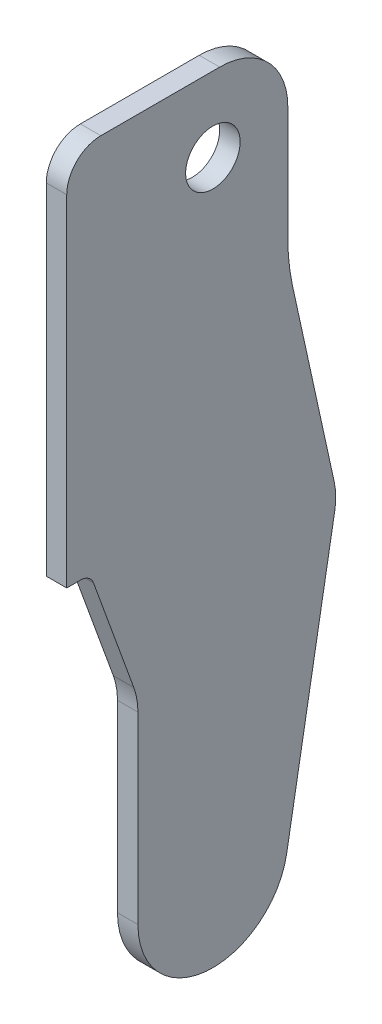
ISO-10303-21;
HEADER;
FILE_DESCRIPTION(('STEP AP214'),'2;1');
FILE_NAME('part.step','',(''),(''),'','','');
FILE_SCHEMA(('AUTOMOTIVE_DESIGN { 1 0 10303 214 1 1 1 1 }'));
ENDSEC;
DATA;
#1=APPLICATION_CONTEXT('core data for automotive mechanical design processes');
#2=APPLICATION_PROTOCOL_DEFINITION('international standard','automotive_design',2000,#1);
#3=PRODUCT_CONTEXT('',#1,'mechanical');
#4=PRODUCT('Part','Part','',(#3));
#5=PRODUCT_RELATED_PRODUCT_CATEGORY('part','',(#4));
#6=PRODUCT_DEFINITION_FORMATION('','',#4);
#7=PRODUCT_DEFINITION_CONTEXT('part definition',#1,'design');
#8=PRODUCT_DEFINITION('design','',#6,#7);
#9=PRODUCT_DEFINITION_SHAPE('','',#8);
#10=(LENGTH_UNIT() NAMED_UNIT(*) SI_UNIT(.MILLI.,.METRE.));
#11=(NAMED_UNIT(*) PLANE_ANGLE_UNIT() SI_UNIT($,.RADIAN.));
#12=(NAMED_UNIT(*) SI_UNIT($,.STERADIAN.) SOLID_ANGLE_UNIT());
#13=UNCERTAINTY_MEASURE_WITH_UNIT(LENGTH_MEASURE(1.E-05),#10,'distance_accuracy_value','');
#14=(GEOMETRIC_REPRESENTATION_CONTEXT(3) GLOBAL_UNCERTAINTY_ASSIGNED_CONTEXT((#13)) GLOBAL_UNIT_ASSIGNED_CONTEXT((#10,
#11,#12)) REPRESENTATION_CONTEXT('',''));
#15=CARTESIAN_POINT('',(0.,0.,0.));
#16=DIRECTION('',(0.,0.,1.));
#17=DIRECTION('',(1.,0.,0.));
#18=AXIS2_PLACEMENT_3D('',#15,#16,#17);
#19=CARTESIAN_POINT('',(17.5,-190.,21.4494897427832));
#20=DIRECTION('',(0.,0.,1.));
#21=DIRECTION('',(1.,0.,0.));
#22=AXIS2_PLACEMENT_3D('',#19,#20,#21);
#23=PLANE('',#22);
#24=DIRECTION('',(0.,1.,0.));
#25=VECTOR('',#24,1.);
#26=CARTESIAN_POINT('',(17.5,-190.,21.4494897427832));
#27=LINE('',#26,#25);
#28=CARTESIAN_POINT('',(17.5,-190.,21.4494897427832));
#29=VERTEX_POINT('',#28);
#30=CARTESIAN_POINT('',(17.5,-140.,21.4494897427832));
#31=VERTEX_POINT('',#30);
#32=EDGE_CURVE('E176',#29,#31,#27,.T.);
#33=ORIENTED_EDGE('',*,*,#32,.T.);
#34=DIRECTION('',(-1.,0.,0.));
#35=VECTOR('',#34,1.);
#36=CARTESIAN_POINT('',(17.5,-140.,21.4494897427832));
#37=LINE('',#36,#35);
#38=CARTESIAN_POINT('',(14.5,-140.,21.4494897427832));
#39=VERTEX_POINT('',#38);
#40=EDGE_CURVE('E245',#31,#39,#37,.T.);
#41=ORIENTED_EDGE('',*,*,#40,.T.);
#42=DIRECTION('',(0.,1.,0.));
#43=VECTOR('',#42,1.);
#44=CARTESIAN_POINT('',(14.5,-190.,21.4494897427832));
#45=LINE('',#44,#43);
#46=CARTESIAN_POINT('',(14.5,-190.,21.4494897427832));
#47=VERTEX_POINT('',#46);
#48=EDGE_CURVE('E213',#47,#39,#45,.T.);
#49=ORIENTED_EDGE('',*,*,#48,.F.);
#50=DIRECTION('',(-1.,0.,0.));
#51=VECTOR('',#50,1.);
#52=CARTESIAN_POINT('',(17.5,-190.,21.4494897427832));
#53=LINE('',#52,#51);
#54=EDGE_CURVE('E243',#29,#47,#53,.T.);
#55=ORIENTED_EDGE('',*,*,#54,.F.);
#56=EDGE_LOOP('',(#33,#41,#49,#55));
#57=FACE_BOUND('',#56,.T.);
#58=ADVANCED_FACE('F39',(#57),#23,.T.);
#59=CARTESIAN_POINT('',(17.5,-190.000000000001,19.40041507642));
#60=DIRECTION('',(0.,-1.,5.28271354274638E-13));
#61=DIRECTION('',(0.,-5.28271354274638E-13,-1.));
#62=AXIS2_PLACEMENT_3D('',#59,#60,#61);
#63=PLANE('',#62);
#64=ORIENTED_EDGE('',*,*,#54,.T.);
#65=DIRECTION('',(0.,5.28271354274638E-13,1.));
#66=VECTOR('',#65,1.);
#67=CARTESIAN_POINT('',(14.5,-190.000000000001,19.40041507642));
#68=LINE('',#67,#66);
#69=CARTESIAN_POINT('',(14.5,-190.000000000002,19.40041507642));
#70=VERTEX_POINT('',#69);
#71=EDGE_CURVE('E180',#70,#47,#68,.T.);
#72=ORIENTED_EDGE('',*,*,#71,.F.);
#73=DIRECTION('',(-1.,0.,0.));
#74=VECTOR('',#73,1.);
#75=CARTESIAN_POINT('',(17.5,-190.000000000002,19.40041507642));
#76=LINE('',#75,#74);
#77=CARTESIAN_POINT('',(17.5,-190.000000000002,19.40041507642));
#78=VERTEX_POINT('',#77);
#79=EDGE_CURVE('E246',#78,#70,#76,.T.);
#80=ORIENTED_EDGE('',*,*,#79,.F.);
#81=DIRECTION('',(0.,5.28271354274638E-13,1.));
#82=VECTOR('',#81,1.);
#83=CARTESIAN_POINT('',(17.5,-190.000000000001,19.40041507642));
#84=LINE('',#83,#82);
#85=EDGE_CURVE('E210',#78,#29,#84,.T.);
#86=ORIENTED_EDGE('',*,*,#85,.T.);
#87=EDGE_LOOP('',(#64,#72,#80,#86));
#88=FACE_BOUND('',#87,.T.);
#89=ADVANCED_FACE('F276',(#88),#63,.T.);
#90=CARTESIAN_POINT('',(17.5,-192.,19.40041507642));
#91=DIRECTION('',(-1.,0.,0.));
#92=DIRECTION('',(0.,0.,1.));
#93=AXIS2_PLACEMENT_3D('',#90,#91,#92);
#94=CYLINDRICAL_SURFACE('',#93,1.99999999999838);
#95=ORIENTED_EDGE('',*,*,#79,.T.);
#96=CARTESIAN_POINT('',(14.5,-192.,19.40041507642));
#97=DIRECTION('',(1.,0.,0.));
#98=DIRECTION('',(0.,0.,1.));
#99=AXIS2_PLACEMENT_3D('',#96,#97,#98);
#100=CIRCLE('',#99,1.99999999999838);
#101=CARTESIAN_POINT('',(14.5,-191.31595971335,17.52102983485));
#102=VERTEX_POINT('',#101);
#103=EDGE_CURVE('E238',#102,#70,#100,.T.);
#104=ORIENTED_EDGE('',*,*,#103,.F.);
#105=DIRECTION('',(-1.,0.,0.));
#106=VECTOR('',#105,1.);
#107=CARTESIAN_POINT('',(17.5,-191.31595971335,17.52102983485));
#108=LINE('',#107,#106);
#109=CARTESIAN_POINT('',(17.5,-191.31595971335,17.52102983485));
#110=VERTEX_POINT('',#109);
#111=EDGE_CURVE('E248',#110,#102,#108,.T.);
#112=ORIENTED_EDGE('',*,*,#111,.F.);
#113=CARTESIAN_POINT('',(17.5,-192.,19.40041507642));
#114=DIRECTION('',(1.,0.,0.));
#115=DIRECTION('',(0.,0.,1.));
#116=AXIS2_PLACEMENT_3D('',#113,#114,#115);
#117=CIRCLE('',#116,1.99999999999838);
#118=EDGE_CURVE('E207',#110,#78,#117,.T.);
#119=ORIENTED_EDGE('',*,*,#118,.T.);
#120=EDGE_LOOP('',(#95,#104,#112,#119));
#121=FACE_BOUND('',#120,.T.);
#122=ADVANCED_FACE('F294',(#121),#94,.F.);
#123=CARTESIAN_POINT('',(17.5,-207.57541031001,11.6030737921409));
#124=DIRECTION('',(0.,-0.342020143325815,0.939692620785855));
#125=DIRECTION('',(0.,-0.939692620785855,-0.342020143325815));
#126=AXIS2_PLACEMENT_3D('',#123,#124,#125);
#127=PLANE('',#126);
#128=ORIENTED_EDGE('',*,*,#111,.T.);
#129=DIRECTION('',(0.,0.939692620785855,0.342020143325814));
#130=VECTOR('',#129,1.);
#131=CARTESIAN_POINT('',(14.5,-207.57541031001,11.6030737921409));
#132=LINE('',#131,#130);
#133=CARTESIAN_POINT('',(14.5,-207.575410310011,11.6030737921414));
#134=VERTEX_POINT('',#133);
#135=EDGE_CURVE('E235',#134,#102,#132,.T.);
#136=ORIENTED_EDGE('',*,*,#135,.F.);
#137=DIRECTION('',(-1.,0.,0.));
#138=VECTOR('',#137,1.);
#139=CARTESIAN_POINT('',(17.5,-207.575410310011,11.6030737921414));
#140=LINE('',#139,#138);
#141=CARTESIAN_POINT('',(17.5,-207.575410310011,11.6030737921414));
#142=VERTEX_POINT('',#141);
#143=EDGE_CURVE('E250',#142,#134,#140,.T.);
#144=ORIENTED_EDGE('',*,*,#143,.F.);
#145=DIRECTION('',(0.,0.939692620785855,0.342020143325814));
#146=VECTOR('',#145,1.);
#147=CARTESIAN_POINT('',(17.5,-207.57541031001,11.6030737921409));
#148=LINE('',#147,#146);
#149=EDGE_CURVE('E204',#142,#110,#148,.T.);
#150=ORIENTED_EDGE('',*,*,#149,.T.);
#151=EDGE_LOOP('',(#128,#136,#144,#150));
#152=FACE_BOUND('',#151,.T.);
#153=ADVANCED_FACE('F329',(#152),#127,.T.);
#154=CARTESIAN_POINT('',(17.5,-210.99561174327,21.));
#155=DIRECTION('',(-1.,0.,0.));
#156=DIRECTION('',(0.,0.,1.));
#157=AXIS2_PLACEMENT_3D('',#154,#155,#156);
#158=CYLINDRICAL_SURFACE('',#157,10.0000000000005);
#159=ORIENTED_EDGE('',*,*,#143,.T.);
#160=CARTESIAN_POINT('',(14.5,-210.99561174327,21.));
#161=DIRECTION('',(1.,0.,0.));
#162=DIRECTION('',(0.,0.,1.));
#163=AXIS2_PLACEMENT_3D('',#160,#161,#162);
#164=CIRCLE('',#163,10.0000000000005);
#165=CARTESIAN_POINT('',(14.5,-210.99561174327,11.));
#166=VERTEX_POINT('',#165);
#167=EDGE_CURVE('E232',#166,#134,#164,.T.);
#168=ORIENTED_EDGE('',*,*,#167,.F.);
#169=DIRECTION('',(-1.,0.,0.));
#170=VECTOR('',#169,1.);
#171=CARTESIAN_POINT('',(17.5,-210.99561174327,11.));
#172=LINE('',#171,#170);
#173=CARTESIAN_POINT('',(17.5,-210.99561174327,11.));
#174=VERTEX_POINT('',#173);
#175=EDGE_CURVE('E252',#174,#166,#172,.T.);
#176=ORIENTED_EDGE('',*,*,#175,.F.);
#177=CARTESIAN_POINT('',(17.5,-210.99561174327,21.));
#178=DIRECTION('',(1.,0.,0.));
#179=DIRECTION('',(0.,0.,1.));
#180=AXIS2_PLACEMENT_3D('',#177,#178,#179);
#181=CIRCLE('',#180,10.0000000000005);
#182=EDGE_CURVE('E201',#174,#142,#181,.T.);
#183=ORIENTED_EDGE('',*,*,#182,.T.);
#184=EDGE_LOOP('',(#159,#168,#176,#183));
#185=FACE_BOUND('',#184,.T.);
#186=ADVANCED_FACE('F325',(#185),#158,.F.);
#187=CARTESIAN_POINT('',(17.5,-238.,10.9999999999979));
#188=DIRECTION('',(0.,0.,1.));
#189=DIRECTION('',(0.,-1.,0.));
#190=AXIS2_PLACEMENT_3D('',#187,#188,#189);
#191=PLANE('',#190);
#192=ORIENTED_EDGE('',*,*,#175,.T.);
#193=DIRECTION('',(0.,1.,0.));
#194=VECTOR('',#193,1.);
#195=CARTESIAN_POINT('',(14.5,-238.,10.9999999999979));
#196=LINE('',#195,#194);
#197=CARTESIAN_POINT('',(14.5,-238.,10.9999999999969));
#198=VERTEX_POINT('',#197);
#199=EDGE_CURVE('E229',#198,#166,#196,.T.);
#200=ORIENTED_EDGE('',*,*,#199,.F.);
#201=DIRECTION('',(-1.,0.,0.));
#202=VECTOR('',#201,1.);
#203=CARTESIAN_POINT('',(17.5,-238.,10.9999999999969));
#204=LINE('',#203,#202);
#205=CARTESIAN_POINT('',(17.5,-238.,10.9999999999969));
#206=VERTEX_POINT('',#205);
#207=EDGE_CURVE('E254',#206,#198,#204,.T.);
#208=ORIENTED_EDGE('',*,*,#207,.F.);
#209=DIRECTION('',(0.,1.,0.));
#210=VECTOR('',#209,1.);
#211=CARTESIAN_POINT('',(17.5,-238.,10.9999999999979));
#212=LINE('',#211,#210);
#213=EDGE_CURVE('E198',#206,#174,#212,.T.);
#214=ORIENTED_EDGE('',*,*,#213,.T.);
#215=EDGE_LOOP('',(#192,#200,#208,#214));
#216=FACE_BOUND('',#215,.T.);
#217=ADVANCED_FACE('F321',(#216),#191,.T.);
#218=CARTESIAN_POINT('',(17.5,-238.,0.));
#219=DIRECTION('',(-1.,0.,0.));
#220=DIRECTION('',(0.,0.,1.));
#221=AXIS2_PLACEMENT_3D('',#218,#219,#220);
#222=CYLINDRICAL_SURFACE('',#221,10.9999999999969);
#223=ORIENTED_EDGE('',*,*,#207,.T.);
#224=CARTESIAN_POINT('',(14.5,-238.,0.));
#225=DIRECTION('',(-1.,0.,0.));
#226=DIRECTION('',(0.,0.,1.));
#227=AXIS2_PLACEMENT_3D('',#224,#225,#226);
#228=CIRCLE('',#227,10.9999999999969);
#229=CARTESIAN_POINT('',(14.5,-239.91012995434,-10.83288528313));
#230=VERTEX_POINT('',#229);
#231=EDGE_CURVE('E226',#230,#198,#228,.T.);
#232=ORIENTED_EDGE('',*,*,#231,.F.);
#233=DIRECTION('',(-1.,0.,0.));
#234=VECTOR('',#233,1.);
#235=CARTESIAN_POINT('',(17.5,-239.91012995434,-10.83288528313));
#236=LINE('',#235,#234);
#237=CARTESIAN_POINT('',(17.5,-239.91012995434,-10.83288528313));
#238=VERTEX_POINT('',#237);
#239=EDGE_CURVE('E256',#238,#230,#236,.T.);
#240=ORIENTED_EDGE('',*,*,#239,.F.);
#241=CARTESIAN_POINT('',(17.5,-238.,0.));
#242=DIRECTION('',(-1.,0.,0.));
#243=DIRECTION('',(0.,0.,1.));
#244=AXIS2_PLACEMENT_3D('',#241,#242,#243);
#245=CIRCLE('',#244,10.9999999999963);
#246=EDGE_CURVE('E196',#238,#206,#245,.T.);
#247=ORIENTED_EDGE('',*,*,#246,.T.);
#248=EDGE_LOOP('',(#223,#232,#240,#247));
#249=FACE_BOUND('',#248,.T.);
#250=ADVANCED_FACE('F317',(#249),#222,.T.);
#251=CARTESIAN_POINT('',(17.5,-199.94512735731,-17.8797935250715));
#252=DIRECTION('',(0.,-0.173648177666962,-0.984807753012202));
#253=DIRECTION('',(0.,0.984807753012202,-0.173648177666962));
#254=AXIS2_PLACEMENT_3D('',#251,#252,#253);
#255=PLANE('',#254);
#256=ORIENTED_EDGE('',*,*,#239,.T.);
#257=DIRECTION('',(0.,-0.984807753012202,0.173648177666962));
#258=VECTOR('',#257,1.);
#259=CARTESIAN_POINT('',(14.5,-199.94512735731,-17.8797935250715));
#260=LINE('',#259,#258);
#261=CARTESIAN_POINT('',(14.5,-199.94512735731,-17.8797935250723));
#262=VERTEX_POINT('',#261);
#263=EDGE_CURVE('E223',#262,#230,#260,.T.);
#264=ORIENTED_EDGE('',*,*,#263,.F.);
#265=DIRECTION('',(-1.,0.,0.));
#266=VECTOR('',#265,1.);
#267=CARTESIAN_POINT('',(17.5,-199.94512735731,-17.8797935250723));
#268=LINE('',#267,#266);
#269=CARTESIAN_POINT('',(17.5,-199.94512735731,-17.8797935250723));
#270=VERTEX_POINT('',#269);
#271=EDGE_CURVE('E258',#270,#262,#268,.T.);
#272=ORIENTED_EDGE('',*,*,#271,.F.);
#273=DIRECTION('',(0.,-0.984807753012202,0.173648177666962));
#274=VECTOR('',#273,1.);
#275=CARTESIAN_POINT('',(17.5,-199.94512735731,-17.8797935250715));
#276=LINE('',#275,#274);
#277=EDGE_CURVE('E193',#270,#238,#276,.T.);
#278=ORIENTED_EDGE('',*,*,#277,.T.);
#279=EDGE_LOOP('',(#256,#264,#272,#278));
#280=FACE_BOUND('',#279,.T.);
#281=ADVANCED_FACE('F313',(#280),#255,.T.);
#282=CARTESIAN_POINT('',(17.5,-198.20864558064,-8.031715994952));
#283=DIRECTION('',(-1.,0.,0.));
#284=DIRECTION('',(0.,0.,1.));
#285=AXIS2_PLACEMENT_3D('',#282,#283,#284);
#286=CYLINDRICAL_SURFACE('',#285,9.99999999999843);
#287=ORIENTED_EDGE('',*,*,#271,.T.);
#288=CARTESIAN_POINT('',(14.5,-198.20864558064,-8.031715994952));
#289=DIRECTION('',(-1.,0.,0.));
#290=DIRECTION('',(0.,0.,1.));
#291=AXIS2_PLACEMENT_3D('',#288,#289,#290);
#292=CIRCLE('',#291,9.99999999999843);
#293=CARTESIAN_POINT('',(14.5,-196.07054058552,-17.80046755438));
#294=VERTEX_POINT('',#293);
#295=EDGE_CURVE('E220',#294,#262,#292,.T.);
#296=ORIENTED_EDGE('',*,*,#295,.F.);
#297=DIRECTION('',(-1.,0.,0.));
#298=VECTOR('',#297,1.);
#299=CARTESIAN_POINT('',(17.5,-196.07054058552,-17.80046755438));
#300=LINE('',#299,#298);
#301=CARTESIAN_POINT('',(17.5,-196.07054058552,-17.80046755438));
#302=VERTEX_POINT('',#301);
#303=EDGE_CURVE('E260',#302,#294,#300,.T.);
#304=ORIENTED_EDGE('',*,*,#303,.F.);
#305=CARTESIAN_POINT('',(17.5,-198.20864558064,-8.031715994952));
#306=DIRECTION('',(-1.,0.,0.));
#307=DIRECTION('',(0.,0.,1.));
#308=AXIS2_PLACEMENT_3D('',#305,#306,#307);
#309=CIRCLE('',#308,9.99999999999843);
#310=EDGE_CURVE('E190',#302,#270,#309,.T.);
#311=ORIENTED_EDGE('',*,*,#310,.T.);
#312=EDGE_LOOP('',(#287,#296,#304,#311));
#313=FACE_BOUND('',#312,.T.);
#314=ADVANCED_FACE('F309',(#313),#286,.T.);
#315=CARTESIAN_POINT('',(17.5,-168.16964120508,-11.6937453217096));
#316=DIRECTION('',(0.,0.213810499511105,-0.976875155943077));
#317=DIRECTION('',(0.,0.976875155943077,0.213810499511105));
#318=AXIS2_PLACEMENT_3D('',#315,#316,#317);
#319=PLANE('',#318);
#320=ORIENTED_EDGE('',*,*,#303,.T.);
#321=DIRECTION('',(0.,-0.976875155943077,-0.213810499511105));
#322=VECTOR('',#321,1.);
#323=CARTESIAN_POINT('',(14.5,-168.16964120508,-11.6937453217096));
#324=LINE('',#323,#322);
#325=CARTESIAN_POINT('',(14.5,-168.16964120508,-11.6937453217094));
#326=VERTEX_POINT('',#325);
#327=EDGE_CURVE('E217',#326,#294,#324,.T.);
#328=ORIENTED_EDGE('',*,*,#327,.F.);
#329=DIRECTION('',(-1.,0.,0.));
#330=VECTOR('',#329,1.);
#331=CARTESIAN_POINT('',(17.5,-168.16964120508,-11.6937453217094));
#332=LINE('',#331,#330);
#333=CARTESIAN_POINT('',(17.5,-168.16964120508,-11.6937453217094));
#334=VERTEX_POINT('',#333);
#335=EDGE_CURVE('E262',#334,#326,#332,.T.);
#336=ORIENTED_EDGE('',*,*,#335,.F.);
#337=DIRECTION('',(0.,-0.976875155943077,-0.213810499511105));
#338=VECTOR('',#337,1.);
#339=CARTESIAN_POINT('',(17.5,-168.16964120508,-11.6937453217096));
#340=LINE('',#339,#338);
#341=EDGE_CURVE('E187',#334,#302,#340,.T.);
#342=ORIENTED_EDGE('',*,*,#341,.T.);
#343=EDGE_LOOP('',(#320,#328,#336,#342));
#344=FACE_BOUND('',#343,.T.);
#345=ADVANCED_FACE('F305',(#344),#319,.T.);
#346=CARTESIAN_POINT('',(17.5,-161.75532621974,-41.));
#347=DIRECTION('',(-1.,0.,0.));
#348=DIRECTION('',(0.,0.,1.));
#349=AXIS2_PLACEMENT_3D('',#346,#347,#348);
#350=CYLINDRICAL_SURFACE('',#349,29.9999999999998);
#351=ORIENTED_EDGE('',*,*,#335,.T.);
#352=CARTESIAN_POINT('',(14.5,-161.75532621974,-41.));
#353=DIRECTION('',(1.,0.,0.));
#354=DIRECTION('',(0.,0.,1.));
#355=AXIS2_PLACEMENT_3D('',#352,#353,#354);
#356=CIRCLE('',#355,29.9999999999998);
#357=CARTESIAN_POINT('',(14.5,-161.75532621974,-11.));
#358=VERTEX_POINT('',#357);
#359=EDGE_CURVE('E153',#358,#326,#356,.T.);
#360=ORIENTED_EDGE('',*,*,#359,.F.);
#361=DIRECTION('',(-1.,0.,0.));
#362=VECTOR('',#361,1.);
#363=CARTESIAN_POINT('',(17.5,-161.75532621974,-11.));
#364=LINE('',#363,#362);
#365=CARTESIAN_POINT('',(17.5,-161.75532621974,-11.));
#366=VERTEX_POINT('',#365);
#367=EDGE_CURVE('E149',#366,#358,#364,.T.);
#368=ORIENTED_EDGE('',*,*,#367,.F.);
#369=CARTESIAN_POINT('',(17.5,-161.75532621974,-41.));
#370=DIRECTION('',(1.,0.,0.));
#371=DIRECTION('',(0.,0.,1.));
#372=AXIS2_PLACEMENT_3D('',#369,#370,#371);
#373=CIRCLE('',#372,29.9999999999998);
#374=EDGE_CURVE('E184',#366,#334,#373,.T.);
#375=ORIENTED_EDGE('',*,*,#374,.T.);
#376=EDGE_LOOP('',(#351,#360,#368,#375));
#377=FACE_BOUND('',#376,.T.);
#378=ADVANCED_FACE('F302',(#377),#350,.F.);
#379=CARTESIAN_POINT('',(17.5,-153.292893218813,-10.9999999999989));
#380=DIRECTION('',(0.,1.32834234824646E-13,-1.));
#381=DIRECTION('',(0.,1.,1.32834234824646E-13));
#382=AXIS2_PLACEMENT_3D('',#379,#380,#381);
#383=PLANE('',#382);
#384=ORIENTED_EDGE('',*,*,#367,.T.);
#385=DIRECTION('',(0.,-1.,-1.32834234824646E-13));
#386=VECTOR('',#385,1.);
#387=CARTESIAN_POINT('',(14.5,-153.292893218813,-10.9999999999989));
#388=LINE('',#387,#386);
#389=CARTESIAN_POINT('',(14.5,-145.,-10.9999999999983));
#390=VERTEX_POINT('',#389);
#391=EDGE_CURVE('E144',#390,#358,#388,.T.);
#392=ORIENTED_EDGE('',*,*,#391,.F.);
#393=DIRECTION('',(-1.,0.,0.));
#394=VECTOR('',#393,1.);
#395=CARTESIAN_POINT('',(43.370057685087,-145.,-10.9999999999983));
#396=LINE('',#395,#394);
#397=CARTESIAN_POINT('',(17.5,-145.,-10.9999999999983));
#398=VERTEX_POINT('',#397);
#399=EDGE_CURVE('E148',#398,#390,#396,.T.);
#400=ORIENTED_EDGE('',*,*,#399,.F.);
#401=DIRECTION('',(0.,-1.,-1.32834234824646E-13));
#402=VECTOR('',#401,1.);
#403=CARTESIAN_POINT('',(17.5,-153.292893218813,-10.9999999999989));
#404=LINE('',#403,#402);
#405=EDGE_CURVE('E182',#398,#366,#404,.T.);
#406=ORIENTED_EDGE('',*,*,#405,.T.);
#407=EDGE_LOOP('',(#384,#392,#400,#406));
#408=FACE_BOUND('',#407,.T.);
#409=ADVANCED_FACE('F146',(#408),#383,.T.);
#410=CARTESIAN_POINT('',(17.5,-135.,21.4494897427832));
#411=DIRECTION('',(0.,1.,0.));
#412=DIRECTION('',(0.,0.,1.));
#413=AXIS2_PLACEMENT_3D('',#410,#411,#412);
#414=PLANE('',#413);
#415=DIRECTION('',(0.,0.,-1.));
#416=VECTOR('',#415,1.);
#417=CARTESIAN_POINT('',(14.5,-135.,21.4494897427832));
#418=LINE('',#417,#416);
#419=CARTESIAN_POINT('',(14.5,-135.,16.4494897427832));
#420=VERTEX_POINT('',#419);
#421=CARTESIAN_POINT('',(14.5,-135.,-0.999999999998242));
#422=VERTEX_POINT('',#421);
#423=EDGE_CURVE('E154',#420,#422,#418,.T.);
#424=ORIENTED_EDGE('',*,*,#423,.F.);
#425=DIRECTION('',(-1.,0.,0.));
#426=VECTOR('',#425,1.);
#427=CARTESIAN_POINT('',(17.5,-135.,16.4494897427832));
#428=LINE('',#427,#426);
#429=CARTESIAN_POINT('',(17.5,-135.,16.4494897427832));
#430=VERTEX_POINT('',#429);
#431=EDGE_CURVE('E47',#420,#430,#428,.F.);
#432=ORIENTED_EDGE('',*,*,#431,.T.);
#433=DIRECTION('',(0.,0.,-1.));
#434=VECTOR('',#433,1.);
#435=CARTESIAN_POINT('',(17.5,-135.,21.4494897427832));
#436=LINE('',#435,#434);
#437=CARTESIAN_POINT('',(17.5,-135.,-0.999999999998242));
#438=VERTEX_POINT('',#437);
#439=EDGE_CURVE('E179',#430,#438,#436,.T.);
#440=ORIENTED_EDGE('',*,*,#439,.T.);
#441=DIRECTION('',(-1.,0.,0.));
#442=VECTOR('',#441,1.);
#443=CARTESIAN_POINT('',(43.370057685087,-135.,-0.999999999998242));
#444=LINE('',#443,#442);
#445=EDGE_CURVE('E164',#438,#422,#444,.T.);
#446=ORIENTED_EDGE('',*,*,#445,.T.);
#447=EDGE_LOOP('',(#424,#432,#440,#446));
#448=FACE_BOUND('',#447,.T.);
#449=ADVANCED_FACE('F297',(#448),#414,.T.);
#450=CARTESIAN_POINT('',(17.5,-137.,7.292893218813));
#451=DIRECTION('',(-1.,0.,0.));
#452=DIRECTION('',(0.,0.,1.));
#453=AXIS2_PLACEMENT_3D('',#450,#451,#452);
#454=PLANE('',#453);
#455=CARTESIAN_POINT('',(17.5,-146.,0.));
#456=DIRECTION('',(-1.,0.,0.));
#457=DIRECTION('',(0.,0.,1.));
#458=AXIS2_PLACEMENT_3D('',#455,#456,#457);
#459=CIRCLE('',#458,4.);
#460=CARTESIAN_POINT('',(17.5,-146.,4.));
#461=VERTEX_POINT('',#460);
#462=EDGE_CURVE('E168',#461,#461,#459,.T.);
#463=ORIENTED_EDGE('',*,*,#462,.T.);
#464=EDGE_LOOP('',(#463));
#465=FACE_BOUND('',#464,.T.);
#466=ORIENTED_EDGE('',*,*,#439,.F.);
#467=CARTESIAN_POINT('',(17.5,-140.,16.4494897427832));
#468=DIRECTION('',(-1.,0.,0.));
#469=DIRECTION('',(0.,0.,1.));
#470=AXIS2_PLACEMENT_3D('',#467,#468,#469);
#471=CIRCLE('',#470,5.);
#472=EDGE_CURVE('E11',#430,#31,#471,.F.);
#473=ORIENTED_EDGE('',*,*,#472,.T.);
#474=ORIENTED_EDGE('',*,*,#32,.F.);
#475=ORIENTED_EDGE('',*,*,#85,.F.);
#476=ORIENTED_EDGE('',*,*,#118,.F.);
#477=ORIENTED_EDGE('',*,*,#149,.F.);
#478=ORIENTED_EDGE('',*,*,#182,.F.);
#479=ORIENTED_EDGE('',*,*,#213,.F.);
#480=ORIENTED_EDGE('',*,*,#246,.F.);
#481=ORIENTED_EDGE('',*,*,#277,.F.);
#482=ORIENTED_EDGE('',*,*,#310,.F.);
#483=ORIENTED_EDGE('',*,*,#341,.F.);
#484=ORIENTED_EDGE('',*,*,#374,.F.);
#485=ORIENTED_EDGE('',*,*,#405,.F.);
#486=CARTESIAN_POINT('',(17.5,-145.,-0.999999999998313));
#487=DIRECTION('',(-1.,0.,0.));
#488=DIRECTION('',(0.,0.,1.));
#489=AXIS2_PLACEMENT_3D('',#486,#487,#488);
#490=CIRCLE('',#489,10.);
#491=EDGE_CURVE('E163',#438,#398,#490,.T.);
#492=ORIENTED_EDGE('',*,*,#491,.F.);
#493=EDGE_LOOP('',(#466,#473,#474,#475,#476,#477,#478,#479,#480,#481,#482,#483,#484,#485,#492));
#494=FACE_BOUND('',#493,.T.);
#495=ADVANCED_FACE('F279',(#465,#494),#454,.F.);
#496=CARTESIAN_POINT('',(14.5,-137.,7.292893218813));
#497=DIRECTION('',(-1.,0.,0.));
#498=DIRECTION('',(0.,0.,1.));
#499=AXIS2_PLACEMENT_3D('',#496,#497,#498);
#500=PLANE('',#499);
#501=CARTESIAN_POINT('',(14.5,-146.,0.));
#502=DIRECTION('',(-1.,0.,0.));
#503=DIRECTION('',(0.,0.,1.));
#504=AXIS2_PLACEMENT_3D('',#501,#502,#503);
#505=CIRCLE('',#504,4.);
#506=CARTESIAN_POINT('',(14.5,-146.,4.));
#507=VERTEX_POINT('',#506);
#508=EDGE_CURVE('E171',#507,#507,#505,.T.);
#509=ORIENTED_EDGE('',*,*,#508,.F.);
#510=EDGE_LOOP('',(#509));
#511=FACE_BOUND('',#510,.T.);
#512=ORIENTED_EDGE('',*,*,#48,.T.);
#513=CARTESIAN_POINT('',(14.5,-140.,16.4494897427832));
#514=DIRECTION('',(-1.,0.,0.));
#515=DIRECTION('',(0.,0.,1.));
#516=AXIS2_PLACEMENT_3D('',#513,#514,#515);
#517=CIRCLE('',#516,5.);
#518=EDGE_CURVE('E61',#39,#420,#517,.T.);
#519=ORIENTED_EDGE('',*,*,#518,.T.);
#520=ORIENTED_EDGE('',*,*,#423,.T.);
#521=CARTESIAN_POINT('',(14.5,-145.,-0.999999999998313));
#522=DIRECTION('',(-1.,0.,0.));
#523=DIRECTION('',(0.,0.,1.));
#524=AXIS2_PLACEMENT_3D('',#521,#522,#523);
#525=CIRCLE('',#524,10.);
#526=EDGE_CURVE('E161',#390,#422,#525,.F.);
#527=ORIENTED_EDGE('',*,*,#526,.F.);
#528=ORIENTED_EDGE('',*,*,#391,.T.);
#529=ORIENTED_EDGE('',*,*,#359,.T.);
#530=ORIENTED_EDGE('',*,*,#327,.T.);
#531=ORIENTED_EDGE('',*,*,#295,.T.);
#532=ORIENTED_EDGE('',*,*,#263,.T.);
#533=ORIENTED_EDGE('',*,*,#231,.T.);
#534=ORIENTED_EDGE('',*,*,#199,.T.);
#535=ORIENTED_EDGE('',*,*,#167,.T.);
#536=ORIENTED_EDGE('',*,*,#135,.T.);
#537=ORIENTED_EDGE('',*,*,#103,.T.);
#538=ORIENTED_EDGE('',*,*,#71,.T.);
#539=EDGE_LOOP('',(#512,#519,#520,#527,#528,#529,#530,#531,#532,#533,#534,#535,#536,#537,#538));
#540=FACE_BOUND('',#539,.T.);
#541=ADVANCED_FACE('F166',(#511,#540),#500,.T.);
#542=CARTESIAN_POINT('',(43.370057685087,-145.,-0.999999999998313));
#543=DIRECTION('',(-1.,0.,0.));
#544=DIRECTION('',(0.,0.,1.));
#545=AXIS2_PLACEMENT_3D('',#542,#543,#544);
#546=CYLINDRICAL_SURFACE('',#545,10.);
#547=ORIENTED_EDGE('',*,*,#445,.F.);
#548=ORIENTED_EDGE('',*,*,#491,.T.);
#549=ORIENTED_EDGE('',*,*,#399,.T.);
#550=ORIENTED_EDGE('',*,*,#526,.T.);
#551=EDGE_LOOP('',(#547,#548,#549,#550));
#552=FACE_BOUND('',#551,.T.);
#553=ADVANCED_FACE('F160',(#552),#546,.T.);
#554=CARTESIAN_POINT('',(17.5,-140.,16.4494897427832));
#555=DIRECTION('',(-1.,0.,0.));
#556=DIRECTION('',(0.,0.,1.));
#557=AXIS2_PLACEMENT_3D('',#554,#555,#556);
#558=CYLINDRICAL_SURFACE('',#557,5.);
#559=ORIENTED_EDGE('',*,*,#472,.F.);
#560=ORIENTED_EDGE('',*,*,#431,.F.);
#561=ORIENTED_EDGE('',*,*,#518,.F.);
#562=ORIENTED_EDGE('',*,*,#40,.F.);
#563=EDGE_LOOP('',(#559,#560,#561,#562));
#564=FACE_BOUND('',#563,.T.);
#565=ADVANCED_FACE('F41',(#564),#558,.T.);
#566=CARTESIAN_POINT('',(24.5,-146.,0.));
#567=DIRECTION('',(-1.,0.,0.));
#568=DIRECTION('',(0.,0.,1.));
#569=AXIS2_PLACEMENT_3D('',#566,#567,#568);
#570=CYLINDRICAL_SURFACE('',#569,4.);
#571=ORIENTED_EDGE('',*,*,#508,.T.);
#572=EDGE_LOOP('',(#571));
#573=FACE_BOUND('',#572,.T.);
#574=ORIENTED_EDGE('',*,*,#462,.F.);
#575=EDGE_LOOP('',(#574));
#576=FACE_BOUND('',#575,.T.);
#577=ADVANCED_FACE('F282',(#573,#576),#570,.F.);
#578=CLOSED_SHELL('',(#58,#89,#122,#153,#186,#217,#250,#281,#314,#345,#378,#409,#449,#495,#541,
#553,#565,#577));
#579=MANIFOLD_SOLID_BREP('B2',#578);
#580=ADVANCED_BREP_SHAPE_REPRESENTATION('',(#18,#579),#14);
#581=SHAPE_DEFINITION_REPRESENTATION(#9,#580);
ENDSEC;
END-ISO-10303-21;
